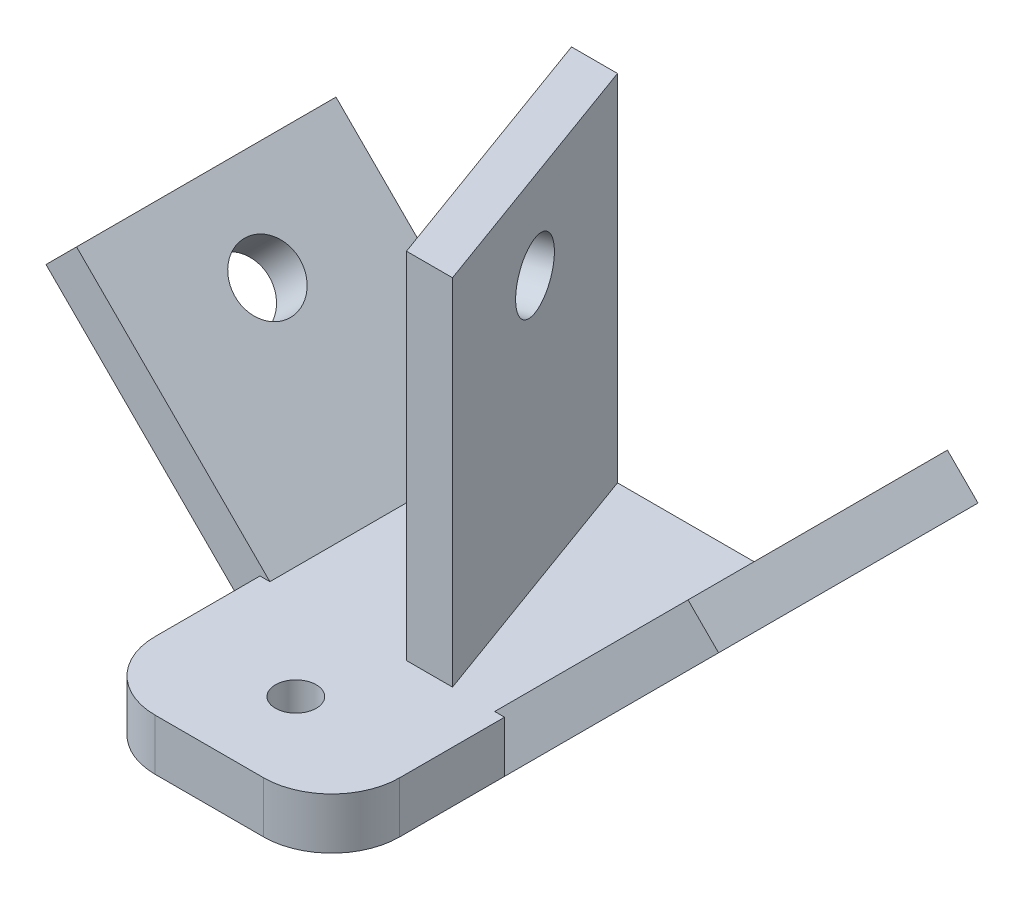
ISO-10303-21;
HEADER;
FILE_DESCRIPTION(('STEP AP214'),'2;1');
FILE_NAME('part.step','',(''),(''),'','','');
FILE_SCHEMA(('AUTOMOTIVE_DESIGN { 1 0 10303 214 1 1 1 1 }'));
ENDSEC;
DATA;
#1=APPLICATION_CONTEXT('core data for automotive mechanical design processes');
#2=APPLICATION_PROTOCOL_DEFINITION('international standard','automotive_design',2000,#1);
#3=PRODUCT_CONTEXT('',#1,'mechanical');
#4=PRODUCT('Part','Part','',(#3));
#5=PRODUCT_RELATED_PRODUCT_CATEGORY('part','',(#4));
#6=PRODUCT_DEFINITION_FORMATION('','',#4);
#7=PRODUCT_DEFINITION_CONTEXT('part definition',#1,'design');
#8=PRODUCT_DEFINITION('design','',#6,#7);
#9=PRODUCT_DEFINITION_SHAPE('','',#8);
#10=(LENGTH_UNIT() NAMED_UNIT(*) SI_UNIT(.MILLI.,.METRE.));
#11=(NAMED_UNIT(*) PLANE_ANGLE_UNIT() SI_UNIT($,.RADIAN.));
#12=(NAMED_UNIT(*) SI_UNIT($,.STERADIAN.) SOLID_ANGLE_UNIT());
#13=UNCERTAINTY_MEASURE_WITH_UNIT(LENGTH_MEASURE(1.E-05),#10,'distance_accuracy_value','');
#14=(GEOMETRIC_REPRESENTATION_CONTEXT(3) GLOBAL_UNCERTAINTY_ASSIGNED_CONTEXT((#13)) GLOBAL_UNIT_ASSIGNED_CONTEXT((#10,
#11,#12)) REPRESENTATION_CONTEXT('',''));
#15=CARTESIAN_POINT('',(0.,0.,0.));
#16=DIRECTION('',(0.,0.,1.));
#17=DIRECTION('',(1.,0.,0.));
#18=AXIS2_PLACEMENT_3D('',#15,#16,#17);
#19=CARTESIAN_POINT('',(0.,0.,19.05));
#20=DIRECTION('',(0.,0.,-1.));
#21=DIRECTION('',(-1.,0.,0.));
#22=AXIS2_PLACEMENT_3D('',#19,#20,#21);
#23=PLANE('',#22);
#24=DIRECTION('',(0.,-1.,0.));
#25=VECTOR('',#24,1.);
#26=CARTESIAN_POINT('',(-17.9605122421383,60.5040905122495,19.05));
#27=LINE('',#26,#25);
#28=CARTESIAN_POINT('',(-17.9605122421384,16.51,19.05));
#29=VERTEX_POINT('',#28);
#30=CARTESIAN_POINT('',(-17.9605122421384,8.98025612106924,19.05));
#31=VERTEX_POINT('',#30);
#32=EDGE_CURVE('E384',#29,#31,#27,.T.);
#33=ORIENTED_EDGE('',*,*,#32,.F.);
#34=DIRECTION('',(1.,0.,0.));
#35=VECTOR('',#34,1.);
#36=CARTESIAN_POINT('',(-17.9605122421383,16.51,19.05));
#37=LINE('',#36,#35);
#38=CARTESIAN_POINT('',(-16.51,16.51,19.05));
#39=VERTEX_POINT('',#38);
#40=EDGE_CURVE('E173',#29,#39,#37,.T.);
#41=ORIENTED_EDGE('',*,*,#40,.T.);
#42=DIRECTION('',(-0.707106781186548,0.707106781186547,0.));
#43=VECTOR('',#42,1.);
#44=CARTESIAN_POINT('',(-44.9012806053458,44.9012806053458,19.05));
#45=LINE('',#44,#43);
#46=CARTESIAN_POINT('',(-44.9012806053458,44.9012806053458,19.05));
#47=VERTEX_POINT('',#46);
#48=EDGE_CURVE('E310',#39,#47,#45,.T.);
#49=ORIENTED_EDGE('',*,*,#48,.T.);
#50=DIRECTION('',(-0.707106781186547,-0.707106781186548,0.));
#51=VECTOR('',#50,1.);
#52=CARTESIAN_POINT('',(-49.3914086658803,40.4111525448112,19.05));
#53=LINE('',#52,#51);
#54=CARTESIAN_POINT('',(-49.3914086658803,40.4111525448112,19.05));
#55=VERTEX_POINT('',#54);
#56=EDGE_CURVE('E313',#47,#55,#53,.T.);
#57=ORIENTED_EDGE('',*,*,#56,.T.);
#58=DIRECTION('',(0.707106781186548,-0.707106781186547,0.));
#59=VECTOR('',#58,1.);
#60=CARTESIAN_POINT('',(0.,-8.98025612106915,19.05));
#61=LINE('',#60,#59);
#62=EDGE_CURVE('E334',#55,#31,#61,.T.);
#63=ORIENTED_EDGE('',*,*,#62,.T.);
#64=EDGE_LOOP('',(#33,#41,#49,#57,#63));
#65=FACE_BOUND('',#64,.T.);
#66=ADVANCED_FACE('F36',(#65),#23,.F.);
#67=DIRECTION('',(0.,-1.,0.));
#68=VECTOR('',#67,1.);
#69=CARTESIAN_POINT('',(3.55486853516007,68.58,19.05));
#70=LINE('',#69,#68);
#71=CARTESIAN_POINT('',(3.55486853516007,68.58,19.05));
#72=VERTEX_POINT('',#71);
#73=CARTESIAN_POINT('',(3.55486853516007,16.51,19.05));
#74=VERTEX_POINT('',#73);
#75=EDGE_CURVE('E327',#72,#74,#70,.T.);
#76=ORIENTED_EDGE('',*,*,#75,.T.);
#77=CARTESIAN_POINT('',(10.3123973903821,16.51,19.05));
#78=VERTEX_POINT('',#77);
#79=EDGE_CURVE('E179',#74,#78,#37,.T.);
#80=ORIENTED_EDGE('',*,*,#79,.T.);
#81=DIRECTION('',(0.,-1.,0.));
#82=VECTOR('',#81,1.);
#83=CARTESIAN_POINT('',(10.3123973903821,68.58,19.05));
#84=LINE('',#83,#82);
#85=CARTESIAN_POINT('',(10.3123973903821,68.58,19.05));
#86=VERTEX_POINT('',#85);
#87=EDGE_CURVE('E341',#86,#78,#84,.T.);
#88=ORIENTED_EDGE('',*,*,#87,.F.);
#89=DIRECTION('',(1.,0.,0.));
#90=VECTOR('',#89,1.);
#91=CARTESIAN_POINT('',(10.3123973903821,68.58,19.05));
#92=LINE('',#91,#90);
#93=EDGE_CURVE('E354',#72,#86,#92,.T.);
#94=ORIENTED_EDGE('',*,*,#93,.F.);
#95=EDGE_LOOP('',(#76,#80,#88,#94));
#96=FACE_BOUND('',#95,.T.);
#97=ADVANCED_FACE('F227',(#96),#23,.F.);
#98=CARTESIAN_POINT('',(0.,0.,19.05));
#99=DIRECTION('',(0.707106781186547,-0.707106781186548,0.));
#100=DIRECTION('',(0.707106781186548,0.707106781186547,0.));
#101=AXIS2_PLACEMENT_3D('',#98,#99,#100);
#102=PLANE('',#101);
#103=CARTESIAN_POINT('',(35.9210244842766,35.9210244842766,0.));
#104=DIRECTION('',(0.707106781186547,-0.707106781186548,0.));
#105=DIRECTION('',(0.707106781186548,0.707106781186547,0.));
#106=AXIS2_PLACEMENT_3D('',#103,#104,#105);
#107=CIRCLE('',#106,4.7625);
#108=CARTESIAN_POINT('',(39.2886205296775,39.2886205296775,0.));
#109=VERTEX_POINT('',#108);
#110=EDGE_CURVE('E363',#109,#109,#107,.T.);
#111=ORIENTED_EDGE('',*,*,#110,.T.);
#112=EDGE_LOOP('',(#111));
#113=FACE_BOUND('',#112,.T.);
#114=DIRECTION('',(-0.707106781186548,-0.707106781186547,0.));
#115=VECTOR('',#114,1.);
#116=CARTESIAN_POINT('',(0.,0.,-19.05));
#117=LINE('',#116,#115);
#118=CARTESIAN_POINT('',(44.9012806053458,44.9012806053457,-19.05));
#119=VERTEX_POINT('',#118);
#120=CARTESIAN_POINT('',(16.51,16.51,-19.05));
#121=VERTEX_POINT('',#120);
#122=EDGE_CURVE('E314',#119,#121,#117,.T.);
#123=ORIENTED_EDGE('',*,*,#122,.T.);
#124=DIRECTION('',(0.,0.,1.));
#125=VECTOR('',#124,1.);
#126=CARTESIAN_POINT('',(16.51,16.51,-55.9674823085215));
#127=LINE('',#126,#125);
#128=CARTESIAN_POINT('',(16.51,16.51,19.05));
#129=VERTEX_POINT('',#128);
#130=EDGE_CURVE('E381',#121,#129,#127,.T.);
#131=ORIENTED_EDGE('',*,*,#130,.T.);
#132=DIRECTION('',(-0.707106781186548,-0.707106781186547,0.));
#133=VECTOR('',#132,1.);
#134=CARTESIAN_POINT('',(0.,0.,19.05));
#135=LINE('',#134,#133);
#136=CARTESIAN_POINT('',(44.9012806053458,44.9012806053457,19.05));
#137=VERTEX_POINT('',#136);
#138=EDGE_CURVE('E178',#137,#129,#135,.T.);
#139=ORIENTED_EDGE('',*,*,#138,.F.);
#140=DIRECTION('',(0.,0.,-1.));
#141=VECTOR('',#140,1.);
#142=CARTESIAN_POINT('',(44.9012806053458,44.9012806053457,19.05));
#143=LINE('',#142,#141);
#144=EDGE_CURVE('E304',#137,#119,#143,.T.);
#145=ORIENTED_EDGE('',*,*,#144,.T.);
#146=EDGE_LOOP('',(#123,#131,#139,#145));
#147=FACE_BOUND('',#146,.T.);
#148=ADVANCED_FACE('F232',(#113,#147),#102,.F.);
#149=CARTESIAN_POINT('',(-44.9012806053458,44.9012806053458,19.05));
#150=DIRECTION('',(-0.707106781186547,-0.707106781186548,0.));
#151=DIRECTION('',(0.707106781186548,-0.707106781186547,0.));
#152=AXIS2_PLACEMENT_3D('',#149,#150,#151);
#153=PLANE('',#152);
#154=CARTESIAN_POINT('',(-35.9210244842766,35.9210244842766,0.));
#155=DIRECTION('',(-0.707106781186547,-0.707106781186548,0.));
#156=DIRECTION('',(0.707106781186548,-0.707106781186547,0.));
#157=AXIS2_PLACEMENT_3D('',#154,#155,#156);
#158=CIRCLE('',#157,4.7625);
#159=CARTESIAN_POINT('',(-32.5534284388757,32.5534284388757,0.));
#160=VERTEX_POINT('',#159);
#161=EDGE_CURVE('E359',#160,#160,#158,.F.);
#162=ORIENTED_EDGE('',*,*,#161,.F.);
#163=EDGE_LOOP('',(#162));
#164=FACE_BOUND('',#163,.T.);
#165=ORIENTED_EDGE('',*,*,#48,.F.);
#166=DIRECTION('',(0.,0.,1.));
#167=VECTOR('',#166,1.);
#168=CARTESIAN_POINT('',(-16.51,16.51,-55.9674823085215));
#169=LINE('',#168,#167);
#170=CARTESIAN_POINT('',(-16.51,16.51,-19.05));
#171=VERTEX_POINT('',#170);
#172=EDGE_CURVE('E380',#171,#39,#169,.T.);
#173=ORIENTED_EDGE('',*,*,#172,.F.);
#174=DIRECTION('',(-0.707106781186548,0.707106781186547,0.));
#175=VECTOR('',#174,1.);
#176=CARTESIAN_POINT('',(-44.9012806053458,44.9012806053458,-19.05));
#177=LINE('',#176,#175);
#178=CARTESIAN_POINT('',(-44.9012806053458,44.9012806053458,-19.05));
#179=VERTEX_POINT('',#178);
#180=EDGE_CURVE('E311',#171,#179,#177,.T.);
#181=ORIENTED_EDGE('',*,*,#180,.T.);
#182=DIRECTION('',(0.,0.,-1.));
#183=VECTOR('',#182,1.);
#184=CARTESIAN_POINT('',(-44.9012806053458,44.9012806053458,19.05));
#185=LINE('',#184,#183);
#186=EDGE_CURVE('E307',#47,#179,#185,.T.);
#187=ORIENTED_EDGE('',*,*,#186,.F.);
#188=EDGE_LOOP('',(#165,#173,#181,#187));
#189=FACE_BOUND('',#188,.T.);
#190=ADVANCED_FACE('F262',(#164,#189),#153,.F.);
#191=CARTESIAN_POINT('',(-49.3914086658803,40.4111525448112,19.05));
#192=DIRECTION('',(0.707106781186548,-0.707106781186547,0.));
#193=DIRECTION('',(0.707106781186547,0.707106781186548,0.));
#194=AXIS2_PLACEMENT_3D('',#191,#192,#193);
#195=PLANE('',#194);
#196=DIRECTION('',(-0.707106781186547,-0.707106781186548,0.));
#197=VECTOR('',#196,1.);
#198=CARTESIAN_POINT('',(-49.3914086658803,40.4111525448112,-19.05));
#199=LINE('',#198,#197);
#200=CARTESIAN_POINT('',(-49.3914086658803,40.4111525448112,-19.05));
#201=VERTEX_POINT('',#200);
#202=EDGE_CURVE('E324',#179,#201,#199,.T.);
#203=ORIENTED_EDGE('',*,*,#202,.T.);
#204=DIRECTION('',(0.,0.,-1.));
#205=VECTOR('',#204,1.);
#206=CARTESIAN_POINT('',(-49.3914086658803,40.4111525448112,19.05));
#207=LINE('',#206,#205);
#208=EDGE_CURVE('E298',#55,#201,#207,.T.);
#209=ORIENTED_EDGE('',*,*,#208,.F.);
#210=ORIENTED_EDGE('',*,*,#56,.F.);
#211=ORIENTED_EDGE('',*,*,#186,.T.);
#212=EDGE_LOOP('',(#203,#209,#210,#211));
#213=FACE_BOUND('',#212,.T.);
#214=ADVANCED_FACE('F259',(#213),#195,.F.);
#215=CARTESIAN_POINT('',(0.,-8.98025612106915,19.05));
#216=DIRECTION('',(0.707106781186547,0.707106781186548,0.));
#217=DIRECTION('',(-0.707106781186548,0.707106781186547,0.));
#218=AXIS2_PLACEMENT_3D('',#215,#216,#217);
#219=PLANE('',#218);
#220=CARTESIAN_POINT('',(-40.4111525448112,31.430896423742,0.));
#221=DIRECTION('',(-0.707106781186547,-0.707106781186548,0.));
#222=DIRECTION('',(0.707106781186548,-0.707106781186547,0.));
#223=AXIS2_PLACEMENT_3D('',#220,#221,#222);
#224=CIRCLE('',#223,4.7625);
#225=CARTESIAN_POINT('',(-37.0435564994103,28.0633003783411,0.));
#226=VERTEX_POINT('',#225);
#227=EDGE_CURVE('E360',#226,#226,#224,.T.);
#228=ORIENTED_EDGE('',*,*,#227,.F.);
#229=EDGE_LOOP('',(#228));
#230=FACE_BOUND('',#229,.T.);
#231=DIRECTION('',(0.707106781186548,-0.707106781186547,0.));
#232=VECTOR('',#231,1.);
#233=CARTESIAN_POINT('',(0.,-8.98025612106915,-19.05));
#234=LINE('',#233,#232);
#235=CARTESIAN_POINT('',(-17.9605122421384,8.98025612106923,-19.05));
#236=VERTEX_POINT('',#235);
#237=EDGE_CURVE('E321',#201,#236,#234,.T.);
#238=ORIENTED_EDGE('',*,*,#237,.T.);
#239=DIRECTION('',(0.,0.,1.));
#240=VECTOR('',#239,1.);
#241=CARTESIAN_POINT('',(-17.9605122421384,8.98025612106923,19.05));
#242=LINE('',#241,#240);
#243=EDGE_CURVE('E180',#236,#31,#242,.T.);
#244=ORIENTED_EDGE('',*,*,#243,.T.);
#245=ORIENTED_EDGE('',*,*,#62,.F.);
#246=ORIENTED_EDGE('',*,*,#208,.T.);
#247=EDGE_LOOP('',(#238,#244,#245,#246));
#248=FACE_BOUND('',#247,.T.);
#249=ADVANCED_FACE('F251',(#230,#248),#219,.F.);
#250=CARTESIAN_POINT('',(49.3914086658803,40.4111525448112,19.05));
#251=DIRECTION('',(-0.707106781186547,0.707106781186548,0.));
#252=DIRECTION('',(-0.707106781186548,-0.707106781186547,0.));
#253=AXIS2_PLACEMENT_3D('',#250,#251,#252);
#254=PLANE('',#253);
#255=CARTESIAN_POINT('',(40.4111525448112,31.430896423742,0.));
#256=DIRECTION('',(-0.707106781186547,0.707106781186548,0.));
#257=DIRECTION('',(-0.707106781186548,-0.707106781186547,0.));
#258=AXIS2_PLACEMENT_3D('',#255,#256,#257);
#259=CIRCLE('',#258,4.7625);
#260=CARTESIAN_POINT('',(37.0435564994103,28.0633003783411,0.));
#261=VERTEX_POINT('',#260);
#262=EDGE_CURVE('E366',#261,#261,#259,.T.);
#263=ORIENTED_EDGE('',*,*,#262,.T.);
#264=EDGE_LOOP('',(#263));
#265=FACE_BOUND('',#264,.T.);
#266=DIRECTION('',(0.707106781186548,0.707106781186547,0.));
#267=VECTOR('',#266,1.);
#268=CARTESIAN_POINT('',(49.3914086658803,40.4111525448112,19.05));
#269=LINE('',#268,#267);
#270=CARTESIAN_POINT('',(17.9605122421383,8.98025612106917,19.05));
#271=VERTEX_POINT('',#270);
#272=CARTESIAN_POINT('',(49.3914086658803,40.4111525448112,19.05));
#273=VERTEX_POINT('',#272);
#274=EDGE_CURVE('E332',#271,#273,#269,.T.);
#275=ORIENTED_EDGE('',*,*,#274,.F.);
#276=DIRECTION('',(0.,0.,-1.));
#277=VECTOR('',#276,1.);
#278=CARTESIAN_POINT('',(17.9605122421383,8.98025612106917,19.05));
#279=LINE('',#278,#277);
#280=CARTESIAN_POINT('',(17.9605122421383,8.98025612106917,-19.05));
#281=VERTEX_POINT('',#280);
#282=EDGE_CURVE('E292',#271,#281,#279,.T.);
#283=ORIENTED_EDGE('',*,*,#282,.T.);
#284=DIRECTION('',(0.707106781186548,0.707106781186547,0.));
#285=VECTOR('',#284,1.);
#286=CARTESIAN_POINT('',(49.3914086658803,40.4111525448112,-19.05));
#287=LINE('',#286,#285);
#288=CARTESIAN_POINT('',(49.3914086658803,40.4111525448112,-19.05));
#289=VERTEX_POINT('',#288);
#290=EDGE_CURVE('E319',#281,#289,#287,.T.);
#291=ORIENTED_EDGE('',*,*,#290,.T.);
#292=DIRECTION('',(0.,0.,-1.));
#293=VECTOR('',#292,1.);
#294=CARTESIAN_POINT('',(49.3914086658803,40.4111525448112,19.05));
#295=LINE('',#294,#293);
#296=EDGE_CURVE('E301',#273,#289,#295,.T.);
#297=ORIENTED_EDGE('',*,*,#296,.F.);
#298=EDGE_LOOP('',(#275,#283,#291,#297));
#299=FACE_BOUND('',#298,.T.);
#300=ADVANCED_FACE('F245',(#265,#299),#254,.F.);
#301=CARTESIAN_POINT('',(44.9012806053458,44.9012806053457,19.05));
#302=DIRECTION('',(-0.707106781186547,-0.707106781186548,0.));
#303=DIRECTION('',(0.707106781186548,-0.707106781186547,0.));
#304=AXIS2_PLACEMENT_3D('',#301,#302,#303);
#305=PLANE('',#304);
#306=DIRECTION('',(-0.707106781186548,0.707106781186547,0.));
#307=VECTOR('',#306,1.);
#308=CARTESIAN_POINT('',(44.9012806053458,44.9012806053457,-19.05));
#309=LINE('',#308,#307);
#310=EDGE_CURVE('E317',#289,#119,#309,.T.);
#311=ORIENTED_EDGE('',*,*,#310,.T.);
#312=ORIENTED_EDGE('',*,*,#144,.F.);
#313=DIRECTION('',(-0.707106781186548,0.707106781186547,0.));
#314=VECTOR('',#313,1.);
#315=CARTESIAN_POINT('',(44.9012806053458,44.9012806053457,19.05));
#316=LINE('',#315,#314);
#317=EDGE_CURVE('E330',#273,#137,#316,.T.);
#318=ORIENTED_EDGE('',*,*,#317,.F.);
#319=ORIENTED_EDGE('',*,*,#296,.T.);
#320=EDGE_LOOP('',(#311,#312,#318,#319));
#321=FACE_BOUND('',#320,.T.);
#322=ADVANCED_FACE('F238',(#321),#305,.F.);
#323=ORIENTED_EDGE('',*,*,#138,.T.);
#324=CARTESIAN_POINT('',(17.9605122421383,16.51,19.05));
#325=VERTEX_POINT('',#324);
#326=EDGE_CURVE('E158',#129,#325,#37,.T.);
#327=ORIENTED_EDGE('',*,*,#326,.T.);
#328=DIRECTION('',(0.,-1.,0.));
#329=VECTOR('',#328,1.);
#330=CARTESIAN_POINT('',(17.9605122421384,60.5040905122495,19.05));
#331=LINE('',#330,#329);
#332=EDGE_CURVE('E165',#325,#271,#331,.T.);
#333=ORIENTED_EDGE('',*,*,#332,.T.);
#334=ORIENTED_EDGE('',*,*,#274,.T.);
#335=ORIENTED_EDGE('',*,*,#317,.T.);
#336=EDGE_LOOP('',(#323,#327,#333,#334,#335));
#337=FACE_BOUND('',#336,.T.);
#338=ADVANCED_FACE('F176',(#337),#23,.F.);
#339=CARTESIAN_POINT('',(0.,0.,-19.05));
#340=DIRECTION('',(0.,0.,-1.));
#341=DIRECTION('',(-1.,0.,0.));
#342=AXIS2_PLACEMENT_3D('',#339,#340,#341);
#343=PLANE('',#342);
#344=ORIENTED_EDGE('',*,*,#290,.F.);
#345=DIRECTION('',(1.,0.,0.));
#346=VECTOR('',#345,1.);
#347=CARTESIAN_POINT('',(0.,8.9802561210692,-19.05));
#348=LINE('',#347,#346);
#349=EDGE_CURVE('E184',#281,#236,#348,.F.);
#350=ORIENTED_EDGE('',*,*,#349,.T.);
#351=ORIENTED_EDGE('',*,*,#237,.F.);
#352=ORIENTED_EDGE('',*,*,#202,.F.);
#353=ORIENTED_EDGE('',*,*,#180,.F.);
#354=DIRECTION('',(-1.,0.,0.));
#355=VECTOR('',#354,1.);
#356=CARTESIAN_POINT('',(-16.51,16.51,-19.05));
#357=LINE('',#356,#355);
#358=CARTESIAN_POINT('',(-10.3123973903821,16.51,-19.05));
#359=VERTEX_POINT('',#358);
#360=EDGE_CURVE('E383',#359,#171,#357,.T.);
#361=ORIENTED_EDGE('',*,*,#360,.F.);
#362=DIRECTION('',(0.,-1.,0.));
#363=VECTOR('',#362,1.);
#364=CARTESIAN_POINT('',(-10.3123973903821,68.58,-19.05));
#365=LINE('',#364,#363);
#366=CARTESIAN_POINT('',(-10.3123973903821,68.58,-19.05));
#367=VERTEX_POINT('',#366);
#368=EDGE_CURVE('E347',#367,#359,#365,.T.);
#369=ORIENTED_EDGE('',*,*,#368,.F.);
#370=DIRECTION('',(-1.,0.,0.));
#371=VECTOR('',#370,1.);
#372=CARTESIAN_POINT('',(-10.3123973903821,68.58,-19.05));
#373=LINE('',#372,#371);
#374=CARTESIAN_POINT('',(-3.55486853516008,68.58,-19.05));
#375=VERTEX_POINT('',#374);
#376=EDGE_CURVE('E350',#375,#367,#373,.T.);
#377=ORIENTED_EDGE('',*,*,#376,.F.);
#378=DIRECTION('',(0.,-1.,0.));
#379=VECTOR('',#378,1.);
#380=CARTESIAN_POINT('',(-3.55486853516008,68.58,-19.05));
#381=LINE('',#380,#379);
#382=CARTESIAN_POINT('',(-3.55486853516008,16.51,-19.05));
#383=VERTEX_POINT('',#382);
#384=EDGE_CURVE('E344',#375,#383,#381,.T.);
#385=ORIENTED_EDGE('',*,*,#384,.T.);
#386=EDGE_CURVE('E386',#121,#383,#357,.T.);
#387=ORIENTED_EDGE('',*,*,#386,.F.);
#388=ORIENTED_EDGE('',*,*,#122,.F.);
#389=ORIENTED_EDGE('',*,*,#310,.F.);
#390=EDGE_LOOP('',(#344,#350,#351,#352,#353,#361,#369,#377,#385,#387,#388,#389));
#391=FACE_BOUND('',#390,.T.);
#392=ADVANCED_FACE('F237',(#391),#343,.T.);
#393=CARTESIAN_POINT('',(3.55486853516007,68.58,19.05));
#394=DIRECTION('',(0.939692620785909,0.,-0.342020143325666));
#395=DIRECTION('',(-0.342020143325666,0.,-0.93969262078591));
#396=AXIS2_PLACEMENT_3D('',#393,#394,#395);
#397=PLANE('',#396);
#398=CARTESIAN_POINT('',(-2.58828371437951,55.88,2.17182791011799));
#399=DIRECTION('',(0.939692620785909,0.,-0.342020143325666));
#400=DIRECTION('',(-0.342020143325666,0.,-0.93969262078591));
#401=AXIS2_PLACEMENT_3D('',#398,#399,#400);
#402=CIRCLE('',#401,4.7625);
#403=CARTESIAN_POINT('',(-4.217154646968,55.88,-2.30345819637491));
#404=VERTEX_POINT('',#403);
#405=EDGE_CURVE('E369',#404,#404,#402,.F.);
#406=ORIENTED_EDGE('',*,*,#405,.F.);
#407=EDGE_LOOP('',(#406));
#408=FACE_BOUND('',#407,.T.);
#409=ORIENTED_EDGE('',*,*,#368,.T.);
#410=DIRECTION('',(0.342020143325666,0.,0.93969262078591));
#411=VECTOR('',#410,1.);
#412=CARTESIAN_POINT('',(3.55486853516007,16.51,19.05));
#413=LINE('',#412,#411);
#414=EDGE_CURVE('E377',#359,#74,#413,.T.);
#415=ORIENTED_EDGE('',*,*,#414,.T.);
#416=ORIENTED_EDGE('',*,*,#75,.F.);
#417=DIRECTION('',(0.342020143325666,0.,0.939692620785909));
#418=VECTOR('',#417,1.);
#419=CARTESIAN_POINT('',(3.55486853516007,68.58,19.05));
#420=LINE('',#419,#418);
#421=EDGE_CURVE('E356',#367,#72,#420,.T.);
#422=ORIENTED_EDGE('',*,*,#421,.F.);
#423=EDGE_LOOP('',(#409,#415,#416,#422));
#424=FACE_BOUND('',#423,.T.);
#425=ADVANCED_FACE('F243',(#408,#424),#397,.F.);
#426=CARTESIAN_POINT('',(-3.55486853516008,68.58,-19.05));
#427=DIRECTION('',(-0.939692620785909,0.,0.342020143325667));
#428=DIRECTION('',(0.342020143325667,0.,0.939692620785909));
#429=AXIS2_PLACEMENT_3D('',#426,#427,#428);
#430=PLANE('',#429);
#431=CARTESIAN_POINT('',(3.37876442761103,55.88,0.));
#432=DIRECTION('',(0.939692620785909,0.,-0.342020143325667));
#433=DIRECTION('',(-0.342020143325667,0.,-0.939692620785909));
#434=AXIS2_PLACEMENT_3D('',#431,#432,#433);
#435=CIRCLE('',#434,4.7625);
#436=CARTESIAN_POINT('',(1.74989349502254,55.88,-4.47528610649289));
#437=VERTEX_POINT('',#436);
#438=EDGE_CURVE('E374',#437,#437,#435,.T.);
#439=ORIENTED_EDGE('',*,*,#438,.F.);
#440=EDGE_LOOP('',(#439));
#441=FACE_BOUND('',#440,.T.);
#442=ORIENTED_EDGE('',*,*,#87,.T.);
#443=DIRECTION('',(-0.342020143325667,0.,-0.939692620785909));
#444=VECTOR('',#443,1.);
#445=CARTESIAN_POINT('',(-3.55486853516008,16.51,-19.05));
#446=LINE('',#445,#444);
#447=EDGE_CURVE('E295',#78,#383,#446,.T.);
#448=ORIENTED_EDGE('',*,*,#447,.T.);
#449=ORIENTED_EDGE('',*,*,#384,.F.);
#450=DIRECTION('',(-0.342020143325667,0.,-0.939692620785909));
#451=VECTOR('',#450,1.);
#452=CARTESIAN_POINT('',(-3.55486853516008,68.58,-19.05));
#453=LINE('',#452,#451);
#454=EDGE_CURVE('E352',#86,#375,#453,.T.);
#455=ORIENTED_EDGE('',*,*,#454,.F.);
#456=EDGE_LOOP('',(#442,#448,#449,#455));
#457=FACE_BOUND('',#456,.T.);
#458=ADVANCED_FACE('F407',(#441,#457),#430,.F.);
#459=CARTESIAN_POINT('',(0.,68.58,0.));
#460=DIRECTION('',(0.,-1.,0.));
#461=DIRECTION('',(0.,0.,-1.));
#462=AXIS2_PLACEMENT_3D('',#459,#460,#461);
#463=PLANE('',#462);
#464=ORIENTED_EDGE('',*,*,#421,.T.);
#465=ORIENTED_EDGE('',*,*,#93,.T.);
#466=ORIENTED_EDGE('',*,*,#454,.T.);
#467=ORIENTED_EDGE('',*,*,#376,.T.);
#468=EDGE_LOOP('',(#464,#465,#466,#467));
#469=FACE_BOUND('',#468,.T.);
#470=ADVANCED_FACE('F415',(#469),#463,.F.);
#471=CARTESIAN_POINT('',(23.0656798486635,94.9077288172168,0.));
#472=DIRECTION('',(-0.707106781186547,-0.707106781186548,0.));
#473=DIRECTION('',(0.707106781186548,-0.707106781186547,0.));
#474=AXIS2_PLACEMENT_3D('',#471,#472,#473);
#475=CYLINDRICAL_SURFACE('',#474,4.7625);
#476=ORIENTED_EDGE('',*,*,#227,.T.);
#477=EDGE_LOOP('',(#476));
#478=FACE_BOUND('',#477,.T.);
#479=ORIENTED_EDGE('',*,*,#161,.T.);
#480=EDGE_LOOP('',(#479));
#481=FACE_BOUND('',#480,.T.);
#482=ADVANCED_FACE('F429',(#478,#481),#475,.F.);
#483=CARTESIAN_POINT('',(-23.0656798486635,94.9077288172168,0.));
#484=DIRECTION('',(0.707106781186547,-0.707106781186548,0.));
#485=DIRECTION('',(0.707106781186548,0.707106781186547,0.));
#486=AXIS2_PLACEMENT_3D('',#483,#484,#485);
#487=CYLINDRICAL_SURFACE('',#486,4.7625);
#488=ORIENTED_EDGE('',*,*,#262,.F.);
#489=EDGE_LOOP('',(#488));
#490=FACE_BOUND('',#489,.T.);
#491=ORIENTED_EDGE('',*,*,#110,.F.);
#492=EDGE_LOOP('',(#491));
#493=FACE_BOUND('',#492,.T.);
#494=ADVANCED_FACE('F222',(#490,#493),#487,.F.);
#495=CARTESIAN_POINT('',(-49.3422274477732,55.88,19.18887176363));
#496=DIRECTION('',(0.939692620785909,0.,-0.342020143325667));
#497=DIRECTION('',(-0.342020143325667,0.,-0.939692620785909));
#498=AXIS2_PLACEMENT_3D('',#495,#496,#497);
#499=CYLINDRICAL_SURFACE('',#498,4.7625);
#500=ORIENTED_EDGE('',*,*,#438,.T.);
#501=EDGE_LOOP('',(#500));
#502=FACE_BOUND('',#501,.T.);
#503=ORIENTED_EDGE('',*,*,#405,.T.);
#504=EDGE_LOOP('',(#503));
#505=FACE_BOUND('',#504,.T.);
#506=ADVANCED_FACE('F215',(#502,#505),#499,.F.);
#507=CARTESIAN_POINT('',(-16.51,16.51,-55.9674823085215));
#508=DIRECTION('',(0.,1.,0.));
#509=DIRECTION('',(0.,0.,1.));
#510=AXIS2_PLACEMENT_3D('',#507,#508,#509);
#511=PLANE('',#510);
#512=CARTESIAN_POINT('',(0.,16.51,31.75));
#513=DIRECTION('',(0.,1.,0.));
#514=DIRECTION('',(0.,0.,1.));
#515=AXIS2_PLACEMENT_3D('',#512,#513,#514);
#516=CIRCLE('',#515,2.999999969);
#517=CARTESIAN_POINT('',(0.,16.51,34.749999969));
#518=VERTEX_POINT('',#517);
#519=EDGE_CURVE('E200',#518,#518,#516,.T.);
#520=ORIENTED_EDGE('',*,*,#519,.F.);
#521=EDGE_LOOP('',(#520));
#522=FACE_BOUND('',#521,.T.);
#523=DIRECTION('',(-1.,0.,0.));
#524=VECTOR('',#523,1.);
#525=CARTESIAN_POINT('',(-17.9605122421383,16.51,44.45));
#526=LINE('',#525,#524);
#527=CARTESIAN_POINT('',(7.96051224213828,16.51,44.45));
#528=VERTEX_POINT('',#527);
#529=CARTESIAN_POINT('',(-7.96051224213835,16.51,44.45));
#530=VERTEX_POINT('',#529);
#531=EDGE_CURVE('E164',#528,#530,#526,.T.);
#532=ORIENTED_EDGE('',*,*,#531,.F.);
#533=CARTESIAN_POINT('',(7.96051224213828,16.51,34.45));
#534=DIRECTION('',(0.,1.,0.));
#535=DIRECTION('',(0.,0.,1.));
#536=AXIS2_PLACEMENT_3D('',#533,#534,#535);
#537=CIRCLE('',#536,10.);
#538=CARTESIAN_POINT('',(17.9605122421383,16.51,34.45));
#539=VERTEX_POINT('',#538);
#540=EDGE_CURVE('E44',#528,#539,#537,.T.);
#541=ORIENTED_EDGE('',*,*,#540,.T.);
#542=DIRECTION('',(0.,0.,1.));
#543=VECTOR('',#542,1.);
#544=CARTESIAN_POINT('',(17.9605122421383,16.51,19.05));
#545=LINE('',#544,#543);
#546=EDGE_CURVE('E153',#325,#539,#545,.T.);
#547=ORIENTED_EDGE('',*,*,#546,.F.);
#548=ORIENTED_EDGE('',*,*,#326,.F.);
#549=ORIENTED_EDGE('',*,*,#130,.F.);
#550=ORIENTED_EDGE('',*,*,#386,.T.);
#551=ORIENTED_EDGE('',*,*,#447,.F.);
#552=ORIENTED_EDGE('',*,*,#79,.F.);
#553=ORIENTED_EDGE('',*,*,#414,.F.);
#554=ORIENTED_EDGE('',*,*,#360,.T.);
#555=ORIENTED_EDGE('',*,*,#172,.T.);
#556=ORIENTED_EDGE('',*,*,#40,.F.);
#557=DIRECTION('',(0.,0.,-1.));
#558=VECTOR('',#557,1.);
#559=CARTESIAN_POINT('',(-17.9605122421383,16.51,19.05));
#560=LINE('',#559,#558);
#561=CARTESIAN_POINT('',(-17.9605122421383,16.51,34.45));
#562=VERTEX_POINT('',#561);
#563=EDGE_CURVE('E388',#562,#29,#560,.T.);
#564=ORIENTED_EDGE('',*,*,#563,.F.);
#565=CARTESIAN_POINT('',(-7.96051224213835,16.51,34.45));
#566=DIRECTION('',(0.,1.,0.));
#567=DIRECTION('',(0.,0.,1.));
#568=AXIS2_PLACEMENT_3D('',#565,#566,#567);
#569=CIRCLE('',#568,10.);
#570=EDGE_CURVE('E56',#562,#530,#569,.T.);
#571=ORIENTED_EDGE('',*,*,#570,.T.);
#572=EDGE_LOOP('',(#532,#541,#547,#548,#549,#550,#551,#552,#553,#554,#555,#556,#564,#571));
#573=FACE_BOUND('',#572,.T.);
#574=ADVANCED_FACE('F155',(#522,#573),#511,.T.);
#575=CARTESIAN_POINT('',(17.9605122421383,8.98025612106917,19.05));
#576=DIRECTION('',(0.,1.,0.));
#577=DIRECTION('',(0.,0.,-1.));
#578=AXIS2_PLACEMENT_3D('',#575,#576,#577);
#579=PLANE('',#578);
#580=CARTESIAN_POINT('',(0.,8.98025612106917,31.75));
#581=DIRECTION('',(0.,1.,0.));
#582=DIRECTION('',(0.,0.,1.));
#583=AXIS2_PLACEMENT_3D('',#580,#581,#582);
#584=CIRCLE('',#583,2.999999969);
#585=CARTESIAN_POINT('',(0.,8.98025612106917,34.749999969));
#586=VERTEX_POINT('',#585);
#587=EDGE_CURVE('E202',#586,#586,#584,.T.);
#588=ORIENTED_EDGE('',*,*,#587,.T.);
#589=EDGE_LOOP('',(#588));
#590=FACE_BOUND('',#589,.T.);
#591=DIRECTION('',(0.,0.,1.));
#592=VECTOR('',#591,1.);
#593=CARTESIAN_POINT('',(17.9605122421383,8.98025612106917,19.05));
#594=LINE('',#593,#592);
#595=CARTESIAN_POINT('',(17.9605122421383,8.98025612106917,34.45));
#596=VERTEX_POINT('',#595);
#597=EDGE_CURVE('E170',#271,#596,#594,.T.);
#598=ORIENTED_EDGE('',*,*,#597,.T.);
#599=CARTESIAN_POINT('',(7.96051224213827,8.98025612106919,34.45));
#600=DIRECTION('',(0.,1.,0.));
#601=DIRECTION('',(-1.,0.,0.));
#602=AXIS2_PLACEMENT_3D('',#599,#600,#601);
#603=CIRCLE('',#602,10.);
#604=CARTESIAN_POINT('',(7.96051224213827,8.98025612106919,44.45));
#605=VERTEX_POINT('',#604);
#606=EDGE_CURVE('E286',#596,#605,#603,.F.);
#607=ORIENTED_EDGE('',*,*,#606,.T.);
#608=DIRECTION('',(-1.,0.,0.));
#609=VECTOR('',#608,1.);
#610=CARTESIAN_POINT('',(-17.9605122421384,8.98025612106924,44.45));
#611=LINE('',#610,#609);
#612=CARTESIAN_POINT('',(-7.96051224213836,8.98025612106922,44.45));
#613=VERTEX_POINT('',#612);
#614=EDGE_CURVE('E188',#605,#613,#611,.T.);
#615=ORIENTED_EDGE('',*,*,#614,.T.);
#616=CARTESIAN_POINT('',(-7.96051224213836,8.98025612106922,34.45));
#617=DIRECTION('',(0.,1.,0.));
#618=DIRECTION('',(-1.,0.,0.));
#619=AXIS2_PLACEMENT_3D('',#616,#617,#618);
#620=CIRCLE('',#619,10.);
#621=CARTESIAN_POINT('',(-17.9605122421384,8.98025612106924,34.45));
#622=VERTEX_POINT('',#621);
#623=EDGE_CURVE('E288',#613,#622,#620,.F.);
#624=ORIENTED_EDGE('',*,*,#623,.T.);
#625=DIRECTION('',(0.,0.,-1.));
#626=VECTOR('',#625,1.);
#627=CARTESIAN_POINT('',(-17.9605122421384,8.98025612106924,19.05));
#628=LINE('',#627,#626);
#629=EDGE_CURVE('E197',#622,#31,#628,.T.);
#630=ORIENTED_EDGE('',*,*,#629,.T.);
#631=ORIENTED_EDGE('',*,*,#243,.F.);
#632=ORIENTED_EDGE('',*,*,#349,.F.);
#633=ORIENTED_EDGE('',*,*,#282,.F.);
#634=EDGE_LOOP('',(#598,#607,#615,#624,#630,#631,#632,#633));
#635=FACE_BOUND('',#634,.T.);
#636=ADVANCED_FACE('F214',(#590,#635),#579,.F.);
#637=CARTESIAN_POINT('',(17.9605122421384,60.5040905122495,19.05));
#638=DIRECTION('',(1.,0.,0.));
#639=DIRECTION('',(0.,1.,0.));
#640=AXIS2_PLACEMENT_3D('',#637,#638,#639);
#641=PLANE('',#640);
#642=ORIENTED_EDGE('',*,*,#546,.T.);
#643=DIRECTION('',(0.,-1.,0.));
#644=VECTOR('',#643,1.);
#645=CARTESIAN_POINT('',(17.9605122421384,60.5040905122495,34.45));
#646=LINE('',#645,#644);
#647=EDGE_CURVE('E182',#539,#596,#646,.T.);
#648=ORIENTED_EDGE('',*,*,#647,.T.);
#649=ORIENTED_EDGE('',*,*,#597,.F.);
#650=ORIENTED_EDGE('',*,*,#332,.F.);
#651=EDGE_LOOP('',(#642,#648,#649,#650));
#652=FACE_BOUND('',#651,.T.);
#653=ADVANCED_FACE('F168',(#652),#641,.T.);
#654=CARTESIAN_POINT('',(-17.9605122421383,60.5040905122495,44.45));
#655=DIRECTION('',(0.,0.,1.));
#656=DIRECTION('',(1.,0.,0.));
#657=AXIS2_PLACEMENT_3D('',#654,#655,#656);
#658=PLANE('',#657);
#659=ORIENTED_EDGE('',*,*,#614,.F.);
#660=DIRECTION('',(0.,-1.,0.));
#661=VECTOR('',#660,1.);
#662=CARTESIAN_POINT('',(7.96051224213836,60.5040905122495,44.45));
#663=LINE('',#662,#661);
#664=EDGE_CURVE('E279',#605,#528,#663,.F.);
#665=ORIENTED_EDGE('',*,*,#664,.T.);
#666=ORIENTED_EDGE('',*,*,#531,.T.);
#667=DIRECTION('',(0.,-1.,0.));
#668=VECTOR('',#667,1.);
#669=CARTESIAN_POINT('',(-7.96051224213827,60.5040905122495,44.45));
#670=LINE('',#669,#668);
#671=EDGE_CURVE('E283',#530,#613,#670,.T.);
#672=ORIENTED_EDGE('',*,*,#671,.T.);
#673=EDGE_LOOP('',(#659,#665,#666,#672));
#674=FACE_BOUND('',#673,.T.);
#675=ADVANCED_FACE('F517',(#674),#658,.T.);
#676=CARTESIAN_POINT('',(-17.9605122421383,60.5040905122495,19.05));
#677=DIRECTION('',(-1.,0.,0.));
#678=DIRECTION('',(0.,-1.,0.));
#679=AXIS2_PLACEMENT_3D('',#676,#677,#678);
#680=PLANE('',#679);
#681=ORIENTED_EDGE('',*,*,#629,.F.);
#682=DIRECTION('',(0.,-1.,0.));
#683=VECTOR('',#682,1.);
#684=CARTESIAN_POINT('',(-17.9605122421383,60.5040905122495,34.45));
#685=LINE('',#684,#683);
#686=EDGE_CURVE('E11',#622,#562,#685,.F.);
#687=ORIENTED_EDGE('',*,*,#686,.T.);
#688=ORIENTED_EDGE('',*,*,#563,.T.);
#689=ORIENTED_EDGE('',*,*,#32,.T.);
#690=EDGE_LOOP('',(#681,#687,#688,#689));
#691=FACE_BOUND('',#690,.T.);
#692=ADVANCED_FACE('F275',(#691),#680,.T.);
#693=CARTESIAN_POINT('',(0.,8.98025612106917,31.75));
#694=DIRECTION('',(0.,1.,0.));
#695=DIRECTION('',(0.,0.,1.));
#696=AXIS2_PLACEMENT_3D('',#693,#694,#695);
#697=CYLINDRICAL_SURFACE('',#696,2.999999969);
#698=ORIENTED_EDGE('',*,*,#587,.F.);
#699=EDGE_LOOP('',(#698));
#700=FACE_BOUND('',#699,.T.);
#701=ORIENTED_EDGE('',*,*,#519,.T.);
#702=EDGE_LOOP('',(#701));
#703=FACE_BOUND('',#702,.T.);
#704=ADVANCED_FACE('F211',(#700,#703),#697,.F.);
#705=CARTESIAN_POINT('',(7.96051224213836,60.5040905122495,34.45));
#706=DIRECTION('',(0.,-1.,0.));
#707=DIRECTION('',(1.,0.,0.));
#708=AXIS2_PLACEMENT_3D('',#705,#706,#707);
#709=CYLINDRICAL_SURFACE('',#708,10.);
#710=ORIENTED_EDGE('',*,*,#540,.F.);
#711=ORIENTED_EDGE('',*,*,#664,.F.);
#712=ORIENTED_EDGE('',*,*,#606,.F.);
#713=ORIENTED_EDGE('',*,*,#647,.F.);
#714=EDGE_LOOP('',(#710,#711,#712,#713));
#715=FACE_BOUND('',#714,.T.);
#716=ADVANCED_FACE('F267',(#715),#709,.T.);
#717=CARTESIAN_POINT('',(-7.96051224213827,60.5040905122495,34.45));
#718=DIRECTION('',(0.,-1.,0.));
#719=DIRECTION('',(1.,0.,0.));
#720=AXIS2_PLACEMENT_3D('',#717,#718,#719);
#721=CYLINDRICAL_SURFACE('',#720,10.);
#722=ORIENTED_EDGE('',*,*,#570,.F.);
#723=ORIENTED_EDGE('',*,*,#686,.F.);
#724=ORIENTED_EDGE('',*,*,#623,.F.);
#725=ORIENTED_EDGE('',*,*,#671,.F.);
#726=EDGE_LOOP('',(#722,#723,#724,#725));
#727=FACE_BOUND('',#726,.T.);
#728=ADVANCED_FACE('F38',(#727),#721,.T.);
#729=CLOSED_SHELL('',(#66,#97,#148,#190,#214,#249,#300,#322,#338,#392,#425,#458,#470,#482,#494,
#506,#574,#636,#653,#675,#692,#704,#716,#728));
#730=MANIFOLD_SOLID_BREP('B2',#729);
#731=ADVANCED_BREP_SHAPE_REPRESENTATION('',(#18,#730),#14);
#732=SHAPE_DEFINITION_REPRESENTATION(#9,#731);
ENDSEC;
END-ISO-10303-21;
